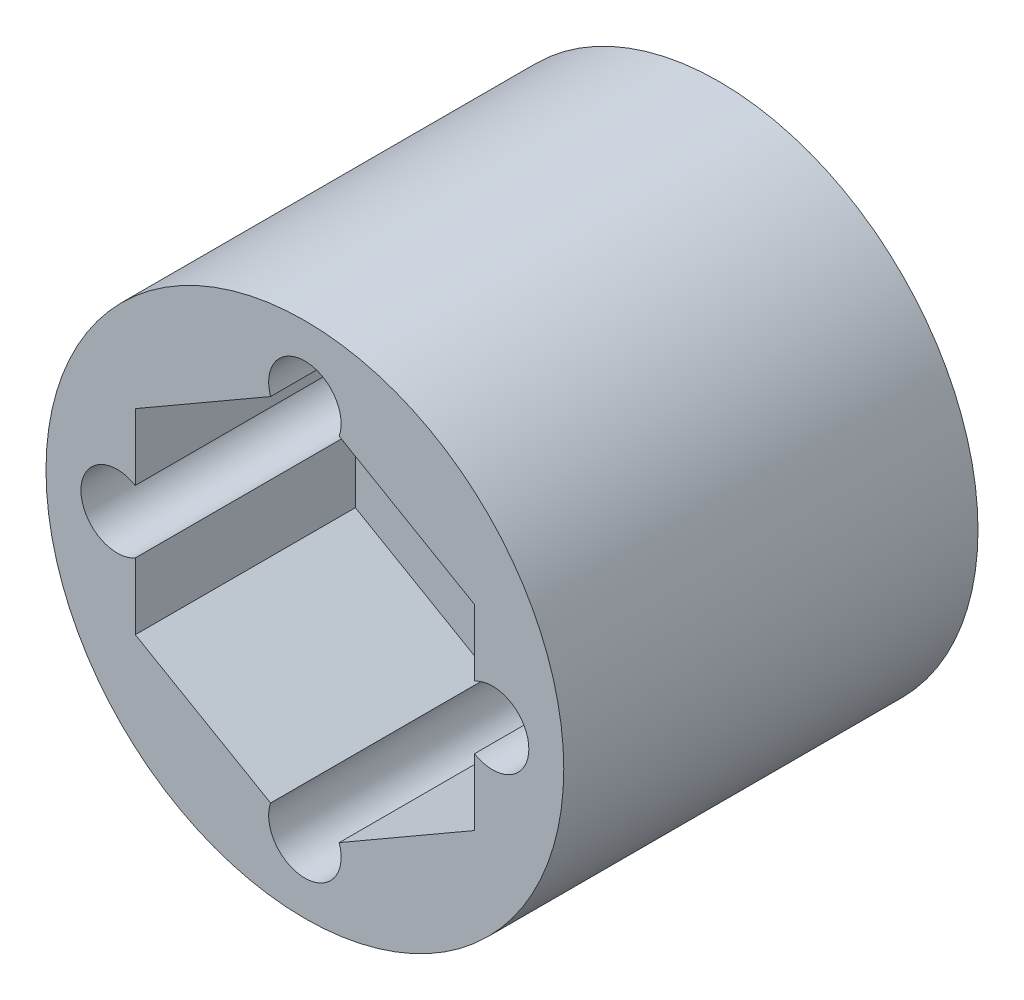
ISO-10303-21;
HEADER;
FILE_DESCRIPTION(('STEP AP214'),'2;1');
FILE_NAME('part.step','',(''),(''),'','','');
FILE_SCHEMA(('AUTOMOTIVE_DESIGN { 1 0 10303 214 1 1 1 1 }'));
ENDSEC;
DATA;
#1=APPLICATION_CONTEXT('core data for automotive mechanical design processes');
#2=APPLICATION_PROTOCOL_DEFINITION('international standard','automotive_design',2000,#1);
#3=PRODUCT_CONTEXT('',#1,'mechanical');
#4=PRODUCT('Part','Part','',(#3));
#5=PRODUCT_RELATED_PRODUCT_CATEGORY('part','',(#4));
#6=PRODUCT_DEFINITION_FORMATION('','',#4);
#7=PRODUCT_DEFINITION_CONTEXT('part definition',#1,'design');
#8=PRODUCT_DEFINITION('design','',#6,#7);
#9=PRODUCT_DEFINITION_SHAPE('','',#8);
#10=(LENGTH_UNIT() NAMED_UNIT(*) SI_UNIT(.MILLI.,.METRE.));
#11=(NAMED_UNIT(*) PLANE_ANGLE_UNIT() SI_UNIT($,.RADIAN.));
#12=(NAMED_UNIT(*) SI_UNIT($,.STERADIAN.) SOLID_ANGLE_UNIT());
#13=UNCERTAINTY_MEASURE_WITH_UNIT(LENGTH_MEASURE(1.E-05),#10,'distance_accuracy_value','');
#14=(GEOMETRIC_REPRESENTATION_CONTEXT(3) GLOBAL_UNCERTAINTY_ASSIGNED_CONTEXT((#13)) GLOBAL_UNIT_ASSIGNED_CONTEXT((#10,
#11,#12)) REPRESENTATION_CONTEXT('',''));
#15=CARTESIAN_POINT('',(0.,0.,0.));
#16=DIRECTION('',(0.,0.,1.));
#17=DIRECTION('',(1.,0.,0.));
#18=AXIS2_PLACEMENT_3D('',#15,#16,#17);
#19=CARTESIAN_POINT('',(0.,0.,16.));
#20=DIRECTION('',(0.,0.,-1.));
#21=DIRECTION('',(-1.,0.,0.));
#22=AXIS2_PLACEMENT_3D('',#19,#20,#21);
#23=CYLINDRICAL_SURFACE('',#22,4.25);
#24=CARTESIAN_POINT('',(0.,0.,0.));
#25=DIRECTION('',(0.,0.,1.));
#26=DIRECTION('',(1.,0.,0.));
#27=AXIS2_PLACEMENT_3D('',#24,#25,#26);
#28=CIRCLE('',#27,4.25);
#29=CARTESIAN_POINT('',(4.25,0.,0.));
#30=VERTEX_POINT('',#29);
#31=EDGE_CURVE('E197',#30,#30,#28,.T.);
#32=ORIENTED_EDGE('',*,*,#31,.F.);
#33=EDGE_LOOP('',(#32));
#34=FACE_BOUND('',#33,.T.);
#35=CARTESIAN_POINT('',(0.,0.,7.5));
#36=DIRECTION('',(0.,0.,1.));
#37=DIRECTION('',(1.,0.,0.));
#38=AXIS2_PLACEMENT_3D('',#35,#36,#37);
#39=CIRCLE('',#38,4.25);
#40=CARTESIAN_POINT('',(4.25,0.,7.5));
#41=VERTEX_POINT('',#40);
#42=EDGE_CURVE('E177',#41,#41,#39,.T.);
#43=ORIENTED_EDGE('',*,*,#42,.T.);
#44=EDGE_LOOP('',(#43));
#45=FACE_BOUND('',#44,.T.);
#46=ADVANCED_FACE('F32',(#34,#45),#23,.F.);
#47=CARTESIAN_POINT('',(0.,0.,16.));
#48=DIRECTION('',(0.,0.,1.));
#49=DIRECTION('',(1.,0.,0.));
#50=AXIS2_PLACEMENT_3D('',#47,#48,#49);
#51=PLANE('',#50);
#52=DIRECTION('',(-0.866025403784439,0.5,0.));
#53=VECTOR('',#52,1.);
#54=CARTESIAN_POINT('',(6.55,3.78164426319205,16.));
#55=LINE('',#54,#53);
#56=CARTESIAN_POINT('',(6.55,3.78164426319205,16.));
#57=VERTEX_POINT('',#56);
#58=CARTESIAN_POINT('',(1.32510769724141,6.79823724067652,16.));
#59=VERTEX_POINT('',#58);
#60=EDGE_CURVE('E150',#57,#59,#55,.T.);
#61=ORIENTED_EDGE('',*,*,#60,.F.);
#62=DIRECTION('',(0.,1.,0.));
#63=VECTOR('',#62,1.);
#64=CARTESIAN_POINT('',(6.55,-3.78164426319205,16.));
#65=LINE('',#64,#63);
#66=CARTESIAN_POINT('',(6.55,1.2124355652983,16.));
#67=VERTEX_POINT('',#66);
#68=EDGE_CURVE('E160',#67,#57,#65,.T.);
#69=ORIENTED_EDGE('',*,*,#68,.F.);
#70=CARTESIAN_POINT('',(7.2500000000002,2.04725589976356E-13,16.));
#71=DIRECTION('',(0.,0.,1.));
#72=DIRECTION('',(1.,0.,0.));
#73=AXIS2_PLACEMENT_3D('',#70,#71,#72);
#74=CIRCLE('',#73,1.4);
#75=CARTESIAN_POINT('',(6.55,-1.21243556529789,16.));
#76=VERTEX_POINT('',#75);
#77=EDGE_CURVE('E194',#76,#67,#74,.T.);
#78=ORIENTED_EDGE('',*,*,#77,.F.);
#79=CARTESIAN_POINT('',(6.55,-3.78164426319205,16.));
#80=VERTEX_POINT('',#79);
#81=EDGE_CURVE('E161',#80,#76,#65,.T.);
#82=ORIENTED_EDGE('',*,*,#81,.F.);
#83=DIRECTION('',(0.866025403784439,0.5,0.));
#84=VECTOR('',#83,1.);
#85=CARTESIAN_POINT('',(0.,-7.56328852638409,16.));
#86=LINE('',#85,#84);
#87=CARTESIAN_POINT('',(1.32510769724175,-6.79823724067632,16.));
#88=VERTEX_POINT('',#87);
#89=EDGE_CURVE('E158',#88,#80,#86,.T.);
#90=ORIENTED_EDGE('',*,*,#89,.F.);
#91=CARTESIAN_POINT('',(4.09451179952713E-13,-7.25,16.));
#92=DIRECTION('',(0.,0.,1.));
#93=DIRECTION('',(1.,0.,0.));
#94=AXIS2_PLACEMENT_3D('',#91,#92,#93);
#95=CIRCLE('',#94,1.4);
#96=CARTESIAN_POINT('',(-1.32510769724107,-6.79823724067672,16.));
#97=VERTEX_POINT('',#96);
#98=EDGE_CURVE('E188',#97,#88,#95,.T.);
#99=ORIENTED_EDGE('',*,*,#98,.F.);
#100=DIRECTION('',(0.866025403784438,-0.5,0.));
#101=VECTOR('',#100,1.);
#102=CARTESIAN_POINT('',(-6.55,-3.78164426319205,16.));
#103=LINE('',#102,#101);
#104=CARTESIAN_POINT('',(-6.55,-3.78164426319205,16.));
#105=VERTEX_POINT('',#104);
#106=EDGE_CURVE('E156',#105,#97,#103,.T.);
#107=ORIENTED_EDGE('',*,*,#106,.F.);
#108=DIRECTION('',(0.,-1.,0.));
#109=VECTOR('',#108,1.);
#110=CARTESIAN_POINT('',(-6.55,3.78164426319205,16.));
#111=LINE('',#110,#109);
#112=CARTESIAN_POINT('',(-6.55,-1.21243556529854,16.));
#113=VERTEX_POINT('',#112);
#114=EDGE_CURVE('E153',#113,#105,#111,.T.);
#115=ORIENTED_EDGE('',*,*,#114,.F.);
#116=CARTESIAN_POINT('',(-7.2499999999998,-2.05613458905738E-13,16.));
#117=DIRECTION('',(0.,0.,1.));
#118=DIRECTION('',(1.,0.,0.));
#119=AXIS2_PLACEMENT_3D('',#116,#117,#118);
#120=CIRCLE('',#119,1.4);
#121=CARTESIAN_POINT('',(-6.55,1.21243556529813,16.));
#122=VERTEX_POINT('',#121);
#123=EDGE_CURVE('E182',#122,#113,#120,.T.);
#124=ORIENTED_EDGE('',*,*,#123,.F.);
#125=CARTESIAN_POINT('',(-6.55,3.78164426319205,16.));
#126=VERTEX_POINT('',#125);
#127=EDGE_CURVE('E154',#126,#122,#111,.T.);
#128=ORIENTED_EDGE('',*,*,#127,.F.);
#129=DIRECTION('',(-0.866025403784439,-0.5,0.));
#130=VECTOR('',#129,1.);
#131=CARTESIAN_POINT('',(0.,7.5632885263841,16.));
#132=LINE('',#131,#130);
#133=CARTESIAN_POINT('',(-1.32510769724141,6.79823724067652,16.));
#134=VERTEX_POINT('',#133);
#135=EDGE_CURVE('E129',#134,#126,#132,.T.);
#136=ORIENTED_EDGE('',*,*,#135,.F.);
#137=CARTESIAN_POINT('',(0.,7.25,16.));
#138=DIRECTION('',(0.,0.,1.));
#139=DIRECTION('',(1.,0.,0.));
#140=AXIS2_PLACEMENT_3D('',#137,#138,#139);
#141=CIRCLE('',#140,1.4);
#142=EDGE_CURVE('E203',#59,#134,#141,.T.);
#143=ORIENTED_EDGE('',*,*,#142,.F.);
#144=EDGE_LOOP('',(#61,#69,#78,#82,#90,#99,#107,#115,#124,#128,#136,#143));
#145=FACE_BOUND('',#144,.T.);
#146=CARTESIAN_POINT('',(0.,0.,16.));
#147=DIRECTION('',(0.,0.,1.));
#148=DIRECTION('',(1.,0.,0.));
#149=AXIS2_PLACEMENT_3D('',#146,#147,#148);
#150=CIRCLE('',#149,10.);
#151=CARTESIAN_POINT('',(10.,0.,16.));
#152=VERTEX_POINT('',#151);
#153=EDGE_CURVE('E209',#152,#152,#150,.T.);
#154=ORIENTED_EDGE('',*,*,#153,.T.);
#155=EDGE_LOOP('',(#154));
#156=FACE_BOUND('',#155,.T.);
#157=ADVANCED_FACE('F230',(#145,#156),#51,.T.);
#158=CARTESIAN_POINT('',(0.,0.,0.));
#159=DIRECTION('',(0.,0.,1.));
#160=DIRECTION('',(1.,0.,0.));
#161=AXIS2_PLACEMENT_3D('',#158,#159,#160);
#162=PLANE('',#161);
#163=CARTESIAN_POINT('',(0.,0.,0.));
#164=DIRECTION('',(0.,0.,1.));
#165=DIRECTION('',(1.,0.,0.));
#166=AXIS2_PLACEMENT_3D('',#163,#164,#165);
#167=CIRCLE('',#166,10.);
#168=CARTESIAN_POINT('',(10.,0.,0.));
#169=VERTEX_POINT('',#168);
#170=EDGE_CURVE('E206',#169,#169,#167,.T.);
#171=ORIENTED_EDGE('',*,*,#170,.F.);
#172=EDGE_LOOP('',(#171));
#173=FACE_BOUND('',#172,.T.);
#174=CARTESIAN_POINT('',(0.,7.25,0.));
#175=DIRECTION('',(0.,0.,1.));
#176=DIRECTION('',(1.,0.,0.));
#177=AXIS2_PLACEMENT_3D('',#174,#175,#176);
#178=CIRCLE('',#177,1.4);
#179=CARTESIAN_POINT('',(1.4,7.25,0.));
#180=VERTEX_POINT('',#179);
#181=EDGE_CURVE('E202',#180,#180,#178,.T.);
#182=ORIENTED_EDGE('',*,*,#181,.T.);
#183=EDGE_LOOP('',(#182));
#184=FACE_BOUND('',#183,.T.);
#185=ORIENTED_EDGE('',*,*,#31,.T.);
#186=EDGE_LOOP('',(#185));
#187=FACE_BOUND('',#186,.T.);
#188=CARTESIAN_POINT('',(7.2500000000002,2.04725589976356E-13,0.));
#189=DIRECTION('',(0.,0.,1.));
#190=DIRECTION('',(1.,0.,0.));
#191=AXIS2_PLACEMENT_3D('',#188,#189,#190);
#192=CIRCLE('',#191,1.4);
#193=CARTESIAN_POINT('',(8.6500000000002,2.04725589976356E-13,0.));
#194=VERTEX_POINT('',#193);
#195=EDGE_CURVE('E191',#194,#194,#192,.T.);
#196=ORIENTED_EDGE('',*,*,#195,.T.);
#197=EDGE_LOOP('',(#196));
#198=FACE_BOUND('',#197,.T.);
#199=CARTESIAN_POINT('',(4.09451179952713E-13,-7.25,0.));
#200=DIRECTION('',(0.,0.,1.));
#201=DIRECTION('',(1.,0.,0.));
#202=AXIS2_PLACEMENT_3D('',#199,#200,#201);
#203=CIRCLE('',#202,1.4);
#204=CARTESIAN_POINT('',(1.40000000000041,-7.25,0.));
#205=VERTEX_POINT('',#204);
#206=EDGE_CURVE('E185',#205,#205,#203,.T.);
#207=ORIENTED_EDGE('',*,*,#206,.T.);
#208=EDGE_LOOP('',(#207));
#209=FACE_BOUND('',#208,.T.);
#210=CARTESIAN_POINT('',(-7.2499999999998,-2.05613458905738E-13,0.));
#211=DIRECTION('',(0.,0.,1.));
#212=DIRECTION('',(1.,0.,0.));
#213=AXIS2_PLACEMENT_3D('',#210,#211,#212);
#214=CIRCLE('',#213,1.4);
#215=CARTESIAN_POINT('',(-5.8499999999998,-2.05613458905738E-13,0.));
#216=VERTEX_POINT('',#215);
#217=EDGE_CURVE('E181',#216,#216,#214,.T.);
#218=ORIENTED_EDGE('',*,*,#217,.T.);
#219=EDGE_LOOP('',(#218));
#220=FACE_BOUND('',#219,.T.);
#221=ADVANCED_FACE('F282',(#173,#184,#187,#198,#209,#220),#162,.F.);
#222=CARTESIAN_POINT('',(0.,0.,16.));
#223=DIRECTION('',(0.,0.,-1.));
#224=DIRECTION('',(-1.,0.,0.));
#225=AXIS2_PLACEMENT_3D('',#222,#223,#224);
#226=CYLINDRICAL_SURFACE('',#225,10.);
#227=ORIENTED_EDGE('',*,*,#153,.F.);
#228=EDGE_LOOP('',(#227));
#229=FACE_BOUND('',#228,.T.);
#230=ORIENTED_EDGE('',*,*,#170,.T.);
#231=EDGE_LOOP('',(#230));
#232=FACE_BOUND('',#231,.T.);
#233=ADVANCED_FACE('F34',(#229,#232),#226,.T.);
#234=CARTESIAN_POINT('',(0.,7.25,16.));
#235=DIRECTION('',(0.,0.,-1.));
#236=DIRECTION('',(-1.,0.,0.));
#237=AXIS2_PLACEMENT_3D('',#234,#235,#236);
#238=CYLINDRICAL_SURFACE('',#237,1.4);
#239=DIRECTION('',(0.,0.,-1.));
#240=VECTOR('',#239,1.);
#241=CARTESIAN_POINT('',(1.32510769724141,6.79823724067652,16.));
#242=LINE('',#241,#240);
#243=CARTESIAN_POINT('',(1.32510769724141,6.79823724067652,7.5));
#244=VERTEX_POINT('',#243);
#245=EDGE_CURVE('E11',#59,#244,#242,.T.);
#246=ORIENTED_EDGE('',*,*,#245,.F.);
#247=ORIENTED_EDGE('',*,*,#142,.T.);
#248=DIRECTION('',(0.,0.,-1.));
#249=VECTOR('',#248,1.);
#250=CARTESIAN_POINT('',(-1.32510769724141,6.79823724067652,16.));
#251=LINE('',#250,#249);
#252=CARTESIAN_POINT('',(-1.32510769724141,6.79823724067652,7.5));
#253=VERTEX_POINT('',#252);
#254=EDGE_CURVE('E40',#253,#134,#251,.F.);
#255=ORIENTED_EDGE('',*,*,#254,.F.);
#256=CARTESIAN_POINT('',(0.,7.25,7.5));
#257=DIRECTION('',(0.,0.,1.));
#258=DIRECTION('',(1.,0.,0.));
#259=AXIS2_PLACEMENT_3D('',#256,#257,#258);
#260=CIRCLE('',#259,1.4);
#261=EDGE_CURVE('E53',#253,#244,#260,.T.);
#262=ORIENTED_EDGE('',*,*,#261,.T.);
#263=EDGE_LOOP('',(#246,#247,#255,#262));
#264=FACE_BOUND('',#263,.T.);
#265=ORIENTED_EDGE('',*,*,#181,.F.);
#266=EDGE_LOOP('',(#265));
#267=FACE_BOUND('',#266,.T.);
#268=ADVANCED_FACE('F234',(#264,#267),#238,.F.);
#269=CARTESIAN_POINT('',(7.2500000000002,2.04725589976356E-13,16.));
#270=DIRECTION('',(0.,0.,-1.));
#271=DIRECTION('',(-1.,0.,0.));
#272=AXIS2_PLACEMENT_3D('',#269,#270,#271);
#273=CYLINDRICAL_SURFACE('',#272,1.4);
#274=DIRECTION('',(0.,0.,-1.));
#275=VECTOR('',#274,1.);
#276=CARTESIAN_POINT('',(6.55,-1.21243556529789,16.));
#277=LINE('',#276,#275);
#278=CARTESIAN_POINT('',(6.55,-1.21243556529789,7.5));
#279=VERTEX_POINT('',#278);
#280=EDGE_CURVE('E225',#76,#279,#277,.T.);
#281=ORIENTED_EDGE('',*,*,#280,.F.);
#282=ORIENTED_EDGE('',*,*,#77,.T.);
#283=DIRECTION('',(0.,0.,-1.));
#284=VECTOR('',#283,1.);
#285=CARTESIAN_POINT('',(6.55,1.2124355652983,16.));
#286=LINE('',#285,#284);
#287=CARTESIAN_POINT('',(6.55,1.2124355652983,7.5));
#288=VERTEX_POINT('',#287);
#289=EDGE_CURVE('E223',#288,#67,#286,.F.);
#290=ORIENTED_EDGE('',*,*,#289,.F.);
#291=CARTESIAN_POINT('',(7.2500000000002,2.04725589976356E-13,7.5));
#292=DIRECTION('',(0.,0.,1.));
#293=DIRECTION('',(1.,0.,0.));
#294=AXIS2_PLACEMENT_3D('',#291,#292,#293);
#295=CIRCLE('',#294,1.4);
#296=EDGE_CURVE('E174',#288,#279,#295,.T.);
#297=ORIENTED_EDGE('',*,*,#296,.T.);
#298=EDGE_LOOP('',(#281,#282,#290,#297));
#299=FACE_BOUND('',#298,.T.);
#300=ORIENTED_EDGE('',*,*,#195,.F.);
#301=EDGE_LOOP('',(#300));
#302=FACE_BOUND('',#301,.T.);
#303=ADVANCED_FACE('F249',(#299,#302),#273,.F.);
#304=CARTESIAN_POINT('',(4.09451179952713E-13,-7.25,16.));
#305=DIRECTION('',(0.,0.,-1.));
#306=DIRECTION('',(-1.,0.,0.));
#307=AXIS2_PLACEMENT_3D('',#304,#305,#306);
#308=CYLINDRICAL_SURFACE('',#307,1.4);
#309=DIRECTION('',(0.,0.,-1.));
#310=VECTOR('',#309,1.);
#311=CARTESIAN_POINT('',(1.32510769724175,-6.79823724067632,16.));
#312=LINE('',#311,#310);
#313=CARTESIAN_POINT('',(1.32510769724175,-6.79823724067632,7.5));
#314=VERTEX_POINT('',#313);
#315=EDGE_CURVE('E221',#314,#88,#312,.F.);
#316=ORIENTED_EDGE('',*,*,#315,.F.);
#317=CARTESIAN_POINT('',(4.09451179952713E-13,-7.25,7.5));
#318=DIRECTION('',(0.,0.,1.));
#319=DIRECTION('',(1.,0.,0.));
#320=AXIS2_PLACEMENT_3D('',#317,#318,#319);
#321=CIRCLE('',#320,1.4);
#322=CARTESIAN_POINT('',(-1.32510769724107,-6.79823724067672,7.5));
#323=VERTEX_POINT('',#322);
#324=EDGE_CURVE('E166',#314,#323,#321,.T.);
#325=ORIENTED_EDGE('',*,*,#324,.T.);
#326=DIRECTION('',(0.,0.,-1.));
#327=VECTOR('',#326,1.);
#328=CARTESIAN_POINT('',(-1.32510769724107,-6.79823724067672,16.));
#329=LINE('',#328,#327);
#330=EDGE_CURVE('E219',#97,#323,#329,.T.);
#331=ORIENTED_EDGE('',*,*,#330,.F.);
#332=ORIENTED_EDGE('',*,*,#98,.T.);
#333=EDGE_LOOP('',(#316,#325,#331,#332));
#334=FACE_BOUND('',#333,.T.);
#335=ORIENTED_EDGE('',*,*,#206,.F.);
#336=EDGE_LOOP('',(#335));
#337=FACE_BOUND('',#336,.T.);
#338=ADVANCED_FACE('F264',(#334,#337),#308,.F.);
#339=CARTESIAN_POINT('',(-7.2499999999998,-2.05613458905738E-13,16.));
#340=DIRECTION('',(0.,0.,-1.));
#341=DIRECTION('',(-1.,0.,0.));
#342=AXIS2_PLACEMENT_3D('',#339,#340,#341);
#343=CYLINDRICAL_SURFACE('',#342,1.4);
#344=DIRECTION('',(0.,0.,-1.));
#345=VECTOR('',#344,1.);
#346=CARTESIAN_POINT('',(-6.55,1.21243556529813,16.));
#347=LINE('',#346,#345);
#348=CARTESIAN_POINT('',(-6.55,1.21243556529813,7.5));
#349=VERTEX_POINT('',#348);
#350=EDGE_CURVE('E137',#122,#349,#347,.T.);
#351=ORIENTED_EDGE('',*,*,#350,.F.);
#352=ORIENTED_EDGE('',*,*,#123,.T.);
#353=DIRECTION('',(0.,0.,-1.));
#354=VECTOR('',#353,1.);
#355=CARTESIAN_POINT('',(-6.55,-1.21243556529854,16.));
#356=LINE('',#355,#354);
#357=CARTESIAN_POINT('',(-6.55,-1.21243556529854,7.5));
#358=VERTEX_POINT('',#357);
#359=EDGE_CURVE('E216',#358,#113,#356,.F.);
#360=ORIENTED_EDGE('',*,*,#359,.F.);
#361=CARTESIAN_POINT('',(-7.2499999999998,-2.05613458905738E-13,7.5));
#362=DIRECTION('',(0.,0.,1.));
#363=DIRECTION('',(1.,0.,0.));
#364=AXIS2_PLACEMENT_3D('',#361,#362,#363);
#365=CIRCLE('',#364,1.4);
#366=EDGE_CURVE('E212',#358,#349,#365,.T.);
#367=ORIENTED_EDGE('',*,*,#366,.T.);
#368=EDGE_LOOP('',(#351,#352,#360,#367));
#369=FACE_BOUND('',#368,.T.);
#370=ORIENTED_EDGE('',*,*,#217,.F.);
#371=EDGE_LOOP('',(#370));
#372=FACE_BOUND('',#371,.T.);
#373=ADVANCED_FACE('F276',(#369,#372),#343,.F.);
#374=CARTESIAN_POINT('',(6.55,-3.78164426319205,7.5));
#375=DIRECTION('',(1.,0.,0.));
#376=DIRECTION('',(0.,1.,0.));
#377=AXIS2_PLACEMENT_3D('',#374,#375,#376);
#378=PLANE('',#377);
#379=ORIENTED_EDGE('',*,*,#280,.T.);
#380=DIRECTION('',(0.,1.,0.));
#381=VECTOR('',#380,1.);
#382=CARTESIAN_POINT('',(6.55,-3.78164426319205,7.5));
#383=LINE('',#382,#381);
#384=CARTESIAN_POINT('',(6.55,-3.78164426319205,7.5));
#385=VERTEX_POINT('',#384);
#386=EDGE_CURVE('E133',#385,#279,#383,.T.);
#387=ORIENTED_EDGE('',*,*,#386,.F.);
#388=DIRECTION('',(0.,0.,1.));
#389=VECTOR('',#388,1.);
#390=CARTESIAN_POINT('',(6.55,-3.78164426319205,7.5));
#391=LINE('',#390,#389);
#392=EDGE_CURVE('E167',#385,#80,#391,.T.);
#393=ORIENTED_EDGE('',*,*,#392,.T.);
#394=ORIENTED_EDGE('',*,*,#81,.T.);
#395=EDGE_LOOP('',(#379,#387,#393,#394));
#396=FACE_BOUND('',#395,.T.);
#397=ADVANCED_FACE('F253',(#396),#378,.F.);
#398=CARTESIAN_POINT('',(-6.55,3.78164426319205,7.5));
#399=DIRECTION('',(-1.,0.,0.));
#400=DIRECTION('',(0.,0.,1.));
#401=AXIS2_PLACEMENT_3D('',#398,#399,#400);
#402=PLANE('',#401);
#403=ORIENTED_EDGE('',*,*,#350,.T.);
#404=DIRECTION('',(0.,-1.,0.));
#405=VECTOR('',#404,1.);
#406=CARTESIAN_POINT('',(-6.55,3.78164426319205,7.5));
#407=LINE('',#406,#405);
#408=CARTESIAN_POINT('',(-6.55,3.78164426319205,7.5));
#409=VERTEX_POINT('',#408);
#410=EDGE_CURVE('E47',#409,#349,#407,.T.);
#411=ORIENTED_EDGE('',*,*,#410,.F.);
#412=DIRECTION('',(0.,0.,1.));
#413=VECTOR('',#412,1.);
#414=CARTESIAN_POINT('',(-6.55,3.78164426319205,7.5));
#415=LINE('',#414,#413);
#416=EDGE_CURVE('E126',#409,#126,#415,.T.);
#417=ORIENTED_EDGE('',*,*,#416,.T.);
#418=ORIENTED_EDGE('',*,*,#127,.T.);
#419=EDGE_LOOP('',(#403,#411,#417,#418));
#420=FACE_BOUND('',#419,.T.);
#421=ADVANCED_FACE('F135',(#420),#402,.F.);
#422=CARTESIAN_POINT('',(6.55,3.78164426319205,7.5));
#423=DIRECTION('',(0.5,0.866025403784439,0.));
#424=DIRECTION('',(-0.866025403784439,0.5,0.));
#425=AXIS2_PLACEMENT_3D('',#422,#423,#424);
#426=PLANE('',#425);
#427=ORIENTED_EDGE('',*,*,#245,.T.);
#428=DIRECTION('',(-0.866025403784439,0.5,0.));
#429=VECTOR('',#428,1.);
#430=CARTESIAN_POINT('',(6.55,3.78164426319205,7.5));
#431=LINE('',#430,#429);
#432=CARTESIAN_POINT('',(6.55,3.78164426319205,7.5));
#433=VERTEX_POINT('',#432);
#434=EDGE_CURVE('E123',#433,#244,#431,.T.);
#435=ORIENTED_EDGE('',*,*,#434,.F.);
#436=DIRECTION('',(0.,0.,1.));
#437=VECTOR('',#436,1.);
#438=CARTESIAN_POINT('',(6.55,3.78164426319205,7.5));
#439=LINE('',#438,#437);
#440=EDGE_CURVE('E163',#433,#57,#439,.T.);
#441=ORIENTED_EDGE('',*,*,#440,.T.);
#442=ORIENTED_EDGE('',*,*,#60,.T.);
#443=EDGE_LOOP('',(#427,#435,#441,#442));
#444=FACE_BOUND('',#443,.T.);
#445=ADVANCED_FACE('F238',(#444),#426,.F.);
#446=ORIENTED_EDGE('',*,*,#289,.T.);
#447=ORIENTED_EDGE('',*,*,#68,.T.);
#448=ORIENTED_EDGE('',*,*,#440,.F.);
#449=EDGE_CURVE('E147',#288,#433,#383,.T.);
#450=ORIENTED_EDGE('',*,*,#449,.F.);
#451=EDGE_LOOP('',(#446,#447,#448,#450));
#452=FACE_BOUND('',#451,.T.);
#453=ADVANCED_FACE('F243',(#452),#378,.F.);
#454=CARTESIAN_POINT('',(0.,-7.56328852638409,7.5));
#455=DIRECTION('',(0.5,-0.866025403784439,0.));
#456=DIRECTION('',(0.866025403784439,0.5,0.));
#457=AXIS2_PLACEMENT_3D('',#454,#455,#456);
#458=PLANE('',#457);
#459=ORIENTED_EDGE('',*,*,#315,.T.);
#460=ORIENTED_EDGE('',*,*,#89,.T.);
#461=ORIENTED_EDGE('',*,*,#392,.F.);
#462=DIRECTION('',(0.866025403784439,0.5,0.));
#463=VECTOR('',#462,1.);
#464=CARTESIAN_POINT('',(0.,-7.56328852638409,7.5));
#465=LINE('',#464,#463);
#466=EDGE_CURVE('E142',#314,#385,#465,.T.);
#467=ORIENTED_EDGE('',*,*,#466,.F.);
#468=EDGE_LOOP('',(#459,#460,#461,#467));
#469=FACE_BOUND('',#468,.T.);
#470=ADVANCED_FACE('F258',(#469),#458,.F.);
#471=CARTESIAN_POINT('',(-6.55,-3.78164426319205,7.5));
#472=DIRECTION('',(-0.5,-0.866025403784439,0.));
#473=DIRECTION('',(0.866025403784439,-0.5,0.));
#474=AXIS2_PLACEMENT_3D('',#471,#472,#473);
#475=PLANE('',#474);
#476=ORIENTED_EDGE('',*,*,#330,.T.);
#477=DIRECTION('',(0.866025403784438,-0.5,0.));
#478=VECTOR('',#477,1.);
#479=CARTESIAN_POINT('',(-6.55,-3.78164426319205,7.5));
#480=LINE('',#479,#478);
#481=CARTESIAN_POINT('',(-6.55,-3.78164426319205,7.5));
#482=VERTEX_POINT('',#481);
#483=EDGE_CURVE('E139',#482,#323,#480,.T.);
#484=ORIENTED_EDGE('',*,*,#483,.F.);
#485=DIRECTION('',(0.,0.,1.));
#486=VECTOR('',#485,1.);
#487=CARTESIAN_POINT('',(-6.55,-3.78164426319205,7.5));
#488=LINE('',#487,#486);
#489=EDGE_CURVE('E132',#482,#105,#488,.T.);
#490=ORIENTED_EDGE('',*,*,#489,.T.);
#491=ORIENTED_EDGE('',*,*,#106,.T.);
#492=EDGE_LOOP('',(#476,#484,#490,#491));
#493=FACE_BOUND('',#492,.T.);
#494=ADVANCED_FACE('F268',(#493),#475,.F.);
#495=ORIENTED_EDGE('',*,*,#359,.T.);
#496=ORIENTED_EDGE('',*,*,#114,.T.);
#497=ORIENTED_EDGE('',*,*,#489,.F.);
#498=EDGE_CURVE('E122',#358,#482,#407,.T.);
#499=ORIENTED_EDGE('',*,*,#498,.F.);
#500=EDGE_LOOP('',(#495,#496,#497,#499));
#501=FACE_BOUND('',#500,.T.);
#502=ADVANCED_FACE('F273',(#501),#402,.F.);
#503=CARTESIAN_POINT('',(0.,7.5632885263841,7.5));
#504=DIRECTION('',(-0.5,0.866025403784439,0.));
#505=DIRECTION('',(-0.866025403784439,-0.5,0.));
#506=AXIS2_PLACEMENT_3D('',#503,#504,#505);
#507=PLANE('',#506);
#508=ORIENTED_EDGE('',*,*,#254,.T.);
#509=ORIENTED_EDGE('',*,*,#135,.T.);
#510=ORIENTED_EDGE('',*,*,#416,.F.);
#511=DIRECTION('',(-0.866025403784439,-0.5,0.));
#512=VECTOR('',#511,1.);
#513=CARTESIAN_POINT('',(0.,7.5632885263841,7.5));
#514=LINE('',#513,#512);
#515=EDGE_CURVE('E117',#253,#409,#514,.T.);
#516=ORIENTED_EDGE('',*,*,#515,.F.);
#517=EDGE_LOOP('',(#508,#509,#510,#516));
#518=FACE_BOUND('',#517,.T.);
#519=ADVANCED_FACE('F127',(#518),#507,.F.);
#520=CARTESIAN_POINT('',(0.,0.,7.5));
#521=DIRECTION('',(0.,0.,1.));
#522=DIRECTION('',(1.,0.,0.));
#523=AXIS2_PLACEMENT_3D('',#520,#521,#522);
#524=PLANE('',#523);
#525=ORIENTED_EDGE('',*,*,#42,.F.);
#526=EDGE_LOOP('',(#525));
#527=FACE_BOUND('',#526,.T.);
#528=ORIENTED_EDGE('',*,*,#515,.T.);
#529=ORIENTED_EDGE('',*,*,#410,.T.);
#530=ORIENTED_EDGE('',*,*,#366,.F.);
#531=ORIENTED_EDGE('',*,*,#498,.T.);
#532=ORIENTED_EDGE('',*,*,#483,.T.);
#533=ORIENTED_EDGE('',*,*,#324,.F.);
#534=ORIENTED_EDGE('',*,*,#466,.T.);
#535=ORIENTED_EDGE('',*,*,#386,.T.);
#536=ORIENTED_EDGE('',*,*,#296,.F.);
#537=ORIENTED_EDGE('',*,*,#449,.T.);
#538=ORIENTED_EDGE('',*,*,#434,.T.);
#539=ORIENTED_EDGE('',*,*,#261,.F.);
#540=EDGE_LOOP('',(#528,#529,#530,#531,#532,#533,#534,#535,#536,#537,#538,#539));
#541=FACE_BOUND('',#540,.T.);
#542=ADVANCED_FACE('F119',(#527,#541),#524,.T.);
#543=CLOSED_SHELL('',(#46,#157,#221,#233,#268,#303,#338,#373,#397,#421,#445,#453,#470,#494,#502,
#519,#542));
#544=MANIFOLD_SOLID_BREP('B2',#543);
#545=ADVANCED_BREP_SHAPE_REPRESENTATION('',(#18,#544),#14);
#546=SHAPE_DEFINITION_REPRESENTATION(#9,#545);
ENDSEC;
END-ISO-10303-21;
